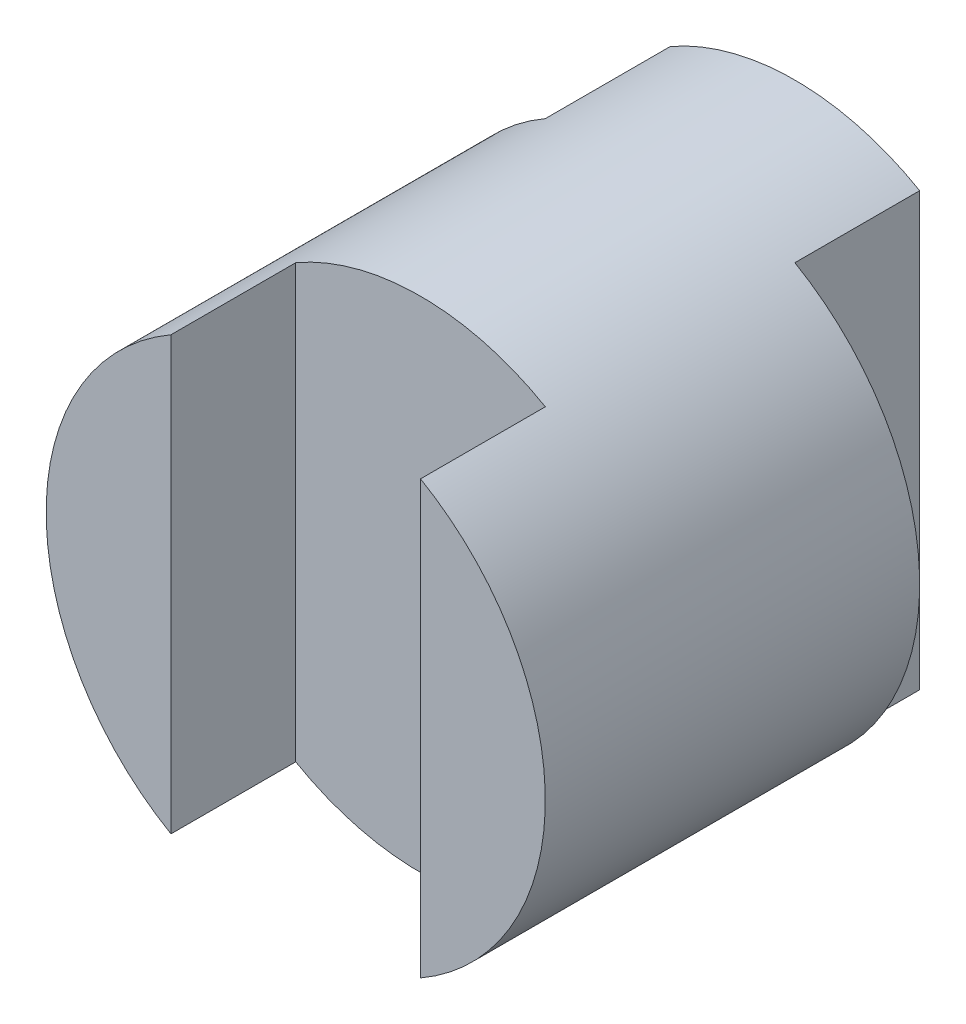
ISO-10303-21;
HEADER;
FILE_DESCRIPTION(('STEP AP214'),'2;1');
FILE_NAME('part.step','',(''),(''),'','','');
FILE_SCHEMA(('AUTOMOTIVE_DESIGN { 1 0 10303 214 1 1 1 1 }'));
ENDSEC;
DATA;
#1=APPLICATION_CONTEXT('core data for automotive mechanical design processes');
#2=APPLICATION_PROTOCOL_DEFINITION('international standard','automotive_design',2000,#1);
#3=PRODUCT_CONTEXT('',#1,'mechanical');
#4=PRODUCT('Part','Part','',(#3));
#5=PRODUCT_RELATED_PRODUCT_CATEGORY('part','',(#4));
#6=PRODUCT_DEFINITION_FORMATION('','',#4);
#7=PRODUCT_DEFINITION_CONTEXT('part definition',#1,'design');
#8=PRODUCT_DEFINITION('design','',#6,#7);
#9=PRODUCT_DEFINITION_SHAPE('','',#8);
#10=(LENGTH_UNIT() NAMED_UNIT(*) SI_UNIT(.MILLI.,.METRE.));
#11=(NAMED_UNIT(*) PLANE_ANGLE_UNIT() SI_UNIT($,.RADIAN.));
#12=(NAMED_UNIT(*) SI_UNIT($,.STERADIAN.) SOLID_ANGLE_UNIT());
#13=UNCERTAINTY_MEASURE_WITH_UNIT(LENGTH_MEASURE(1.E-05),#10,'distance_accuracy_value','');
#14=(GEOMETRIC_REPRESENTATION_CONTEXT(3) GLOBAL_UNCERTAINTY_ASSIGNED_CONTEXT((#13)) GLOBAL_UNIT_ASSIGNED_CONTEXT((#10,
#11,#12)) REPRESENTATION_CONTEXT('',''));
#15=CARTESIAN_POINT('',(0.,0.,0.));
#16=DIRECTION('',(0.,0.,1.));
#17=DIRECTION('',(1.,0.,0.));
#18=AXIS2_PLACEMENT_3D('',#15,#16,#17);
#19=CARTESIAN_POINT('',(0.,0.,4.));
#20=DIRECTION('',(0.,0.,1.));
#21=DIRECTION('',(1.,0.,0.));
#22=AXIS2_PLACEMENT_3D('',#19,#20,#21);
#23=PLANE('',#22);
#24=DIRECTION('',(0.,1.,0.));
#25=VECTOR('',#24,1.);
#26=CARTESIAN_POINT('',(1.,0.,4.));
#27=LINE('',#26,#25);
#28=CARTESIAN_POINT('',(1.,-1.73205080756888,4.));
#29=VERTEX_POINT('',#28);
#30=CARTESIAN_POINT('',(1.,1.73205080756888,4.));
#31=VERTEX_POINT('',#30);
#32=EDGE_CURVE('E127',#29,#31,#27,.T.);
#33=ORIENTED_EDGE('',*,*,#32,.F.);
#34=CARTESIAN_POINT('',(0.,0.,4.));
#35=DIRECTION('',(0.,0.,1.));
#36=DIRECTION('',(1.,0.,0.));
#37=AXIS2_PLACEMENT_3D('',#34,#35,#36);
#38=CIRCLE('',#37,2.);
#39=EDGE_CURVE('E117',#29,#31,#38,.T.);
#40=ORIENTED_EDGE('',*,*,#39,.T.);
#41=EDGE_LOOP('',(#33,#40));
#42=FACE_BOUND('',#41,.T.);
#43=ADVANCED_FACE('F32',(#42),#23,.T.);
#44=CARTESIAN_POINT('',(0.,0.,4.));
#45=DIRECTION('',(0.,0.,-1.));
#46=DIRECTION('',(-1.,0.,0.));
#47=AXIS2_PLACEMENT_3D('',#44,#45,#46);
#48=CYLINDRICAL_SURFACE('',#47,2.);
#49=CARTESIAN_POINT('',(0.,0.,3.));
#50=DIRECTION('',(0.,0.,-1.));
#51=DIRECTION('',(-1.,0.,0.));
#52=AXIS2_PLACEMENT_3D('',#49,#50,#51);
#53=CIRCLE('',#52,2.);
#54=CARTESIAN_POINT('',(-1.,1.73205080756888,3.));
#55=VERTEX_POINT('',#54);
#56=CARTESIAN_POINT('',(1.,1.73205080756888,3.));
#57=VERTEX_POINT('',#56);
#58=EDGE_CURVE('E104',#55,#57,#53,.T.);
#59=ORIENTED_EDGE('',*,*,#58,.T.);
#60=DIRECTION('',(0.,0.,-1.));
#61=VECTOR('',#60,1.);
#62=CARTESIAN_POINT('',(1.,1.73205080756888,4.));
#63=LINE('',#62,#61);
#64=EDGE_CURVE('E119',#57,#31,#63,.F.);
#65=ORIENTED_EDGE('',*,*,#64,.T.);
#66=ORIENTED_EDGE('',*,*,#39,.F.);
#67=DIRECTION('',(0.,0.,-1.));
#68=VECTOR('',#67,1.);
#69=CARTESIAN_POINT('',(1.,-1.73205080756888,4.));
#70=LINE('',#69,#68);
#71=CARTESIAN_POINT('',(1.,-1.73205080756888,3.));
#72=VERTEX_POINT('',#71);
#73=EDGE_CURVE('E115',#29,#72,#70,.T.);
#74=ORIENTED_EDGE('',*,*,#73,.T.);
#75=CARTESIAN_POINT('',(-1.,-1.73205080756888,3.));
#76=VERTEX_POINT('',#75);
#77=EDGE_CURVE('E132',#72,#76,#53,.T.);
#78=ORIENTED_EDGE('',*,*,#77,.T.);
#79=DIRECTION('',(0.,0.,-1.));
#80=VECTOR('',#79,1.);
#81=CARTESIAN_POINT('',(-1.,-1.73205080756888,4.));
#82=LINE('',#81,#80);
#83=CARTESIAN_POINT('',(-1.,-1.73205080756888,4.));
#84=VERTEX_POINT('',#83);
#85=EDGE_CURVE('E149',#76,#84,#82,.F.);
#86=ORIENTED_EDGE('',*,*,#85,.T.);
#87=CARTESIAN_POINT('',(-1.,1.73205080756888,4.));
#88=VERTEX_POINT('',#87);
#89=EDGE_CURVE('E125',#88,#84,#38,.T.);
#90=ORIENTED_EDGE('',*,*,#89,.F.);
#91=DIRECTION('',(0.,0.,-1.));
#92=VECTOR('',#91,1.);
#93=CARTESIAN_POINT('',(-1.,1.73205080756888,4.));
#94=LINE('',#93,#92);
#95=EDGE_CURVE('E55',#88,#55,#94,.T.);
#96=ORIENTED_EDGE('',*,*,#95,.T.);
#97=EDGE_LOOP('',(#59,#65,#66,#74,#78,#86,#90,#96));
#98=FACE_BOUND('',#97,.T.);
#99=CARTESIAN_POINT('',(0.,0.,1.));
#100=DIRECTION('',(0.,0.,1.));
#101=DIRECTION('',(1.,0.,0.));
#102=AXIS2_PLACEMENT_3D('',#99,#100,#101);
#103=CIRCLE('',#102,2.);
#104=CARTESIAN_POINT('',(1.,-1.73205080756888,1.));
#105=VERTEX_POINT('',#104);
#106=CARTESIAN_POINT('',(1.,1.73205080756888,1.));
#107=VERTEX_POINT('',#106);
#108=EDGE_CURVE('E11',#105,#107,#103,.T.);
#109=ORIENTED_EDGE('',*,*,#108,.T.);
#110=DIRECTION('',(0.,0.,-1.));
#111=VECTOR('',#110,1.);
#112=CARTESIAN_POINT('',(1.,1.73205080756888,4.));
#113=LINE('',#112,#111);
#114=CARTESIAN_POINT('',(1.,1.73205080756888,0.));
#115=VERTEX_POINT('',#114);
#116=EDGE_CURVE('E98',#107,#115,#113,.T.);
#117=ORIENTED_EDGE('',*,*,#116,.T.);
#118=CARTESIAN_POINT('',(0.,0.,0.));
#119=DIRECTION('',(0.,0.,1.));
#120=DIRECTION('',(1.,0.,0.));
#121=AXIS2_PLACEMENT_3D('',#118,#119,#120);
#122=CIRCLE('',#121,2.);
#123=CARTESIAN_POINT('',(-1.,1.73205080756888,0.));
#124=VERTEX_POINT('',#123);
#125=EDGE_CURVE('E107',#115,#124,#122,.T.);
#126=ORIENTED_EDGE('',*,*,#125,.T.);
#127=DIRECTION('',(0.,0.,-1.));
#128=VECTOR('',#127,1.);
#129=CARTESIAN_POINT('',(-1.,1.73205080756888,4.));
#130=LINE('',#129,#128);
#131=CARTESIAN_POINT('',(-1.,1.73205080756888,1.));
#132=VERTEX_POINT('',#131);
#133=EDGE_CURVE('E151',#124,#132,#130,.F.);
#134=ORIENTED_EDGE('',*,*,#133,.T.);
#135=CARTESIAN_POINT('',(0.,0.,1.));
#136=DIRECTION('',(0.,0.,1.));
#137=DIRECTION('',(1.,0.,0.));
#138=AXIS2_PLACEMENT_3D('',#135,#136,#137);
#139=CIRCLE('',#138,2.);
#140=CARTESIAN_POINT('',(-1.,-1.73205080756888,1.));
#141=VERTEX_POINT('',#140);
#142=EDGE_CURVE('E129',#132,#141,#139,.T.);
#143=ORIENTED_EDGE('',*,*,#142,.T.);
#144=DIRECTION('',(0.,0.,-1.));
#145=VECTOR('',#144,1.);
#146=CARTESIAN_POINT('',(-1.,-1.73205080756888,4.));
#147=LINE('',#146,#145);
#148=CARTESIAN_POINT('',(-1.,-1.73205080756888,0.));
#149=VERTEX_POINT('',#148);
#150=EDGE_CURVE('E157',#141,#149,#147,.T.);
#151=ORIENTED_EDGE('',*,*,#150,.T.);
#152=CARTESIAN_POINT('',(1.,-1.73205080756888,0.));
#153=VERTEX_POINT('',#152);
#154=EDGE_CURVE('E114',#149,#153,#122,.T.);
#155=ORIENTED_EDGE('',*,*,#154,.T.);
#156=DIRECTION('',(0.,0.,-1.));
#157=VECTOR('',#156,1.);
#158=CARTESIAN_POINT('',(1.,-1.73205080756888,4.));
#159=LINE('',#158,#157);
#160=EDGE_CURVE('E47',#153,#105,#159,.F.);
#161=ORIENTED_EDGE('',*,*,#160,.T.);
#162=EDGE_LOOP('',(#109,#117,#126,#134,#143,#151,#155,#161));
#163=FACE_BOUND('',#162,.T.);
#164=ADVANCED_FACE('F34',(#98,#163),#48,.T.);
#165=DIRECTION('',(0.,-1.,0.));
#166=VECTOR('',#165,1.);
#167=CARTESIAN_POINT('',(-1.,0.,4.));
#168=LINE('',#167,#166);
#169=EDGE_CURVE('E124',#88,#84,#168,.T.);
#170=ORIENTED_EDGE('',*,*,#169,.F.);
#171=ORIENTED_EDGE('',*,*,#89,.T.);
#172=EDGE_LOOP('',(#170,#171));
#173=FACE_BOUND('',#172,.T.);
#174=ADVANCED_FACE('F164',(#173),#23,.T.);
#175=CARTESIAN_POINT('',(0.,0.,0.));
#176=DIRECTION('',(0.,0.,1.));
#177=DIRECTION('',(1.,0.,0.));
#178=AXIS2_PLACEMENT_3D('',#175,#176,#177);
#179=PLANE('',#178);
#180=ORIENTED_EDGE('',*,*,#125,.F.);
#181=DIRECTION('',(0.,-1.,0.));
#182=VECTOR('',#181,1.);
#183=CARTESIAN_POINT('',(1.,0.,0.));
#184=LINE('',#183,#182);
#185=EDGE_CURVE('E40',#115,#153,#184,.T.);
#186=ORIENTED_EDGE('',*,*,#185,.T.);
#187=ORIENTED_EDGE('',*,*,#154,.F.);
#188=DIRECTION('',(0.,1.,0.));
#189=VECTOR('',#188,1.);
#190=CARTESIAN_POINT('',(-1.,0.,0.));
#191=LINE('',#190,#189);
#192=EDGE_CURVE('E113',#149,#124,#191,.T.);
#193=ORIENTED_EDGE('',*,*,#192,.T.);
#194=EDGE_LOOP('',(#180,#186,#187,#193));
#195=FACE_BOUND('',#194,.T.);
#196=ADVANCED_FACE('F112',(#195),#179,.F.);
#197=CARTESIAN_POINT('',(-2.31386891999832,-5.,1.));
#198=DIRECTION('',(0.,0.,1.));
#199=DIRECTION('',(1.,0.,0.));
#200=AXIS2_PLACEMENT_3D('',#197,#198,#199);
#201=PLANE('',#200);
#202=DIRECTION('',(0.,1.,0.));
#203=VECTOR('',#202,1.);
#204=CARTESIAN_POINT('',(-1.,-5.,1.));
#205=LINE('',#204,#203);
#206=EDGE_CURVE('E109',#141,#132,#205,.T.);
#207=ORIENTED_EDGE('',*,*,#206,.F.);
#208=ORIENTED_EDGE('',*,*,#142,.F.);
#209=EDGE_LOOP('',(#207,#208));
#210=FACE_BOUND('',#209,.T.);
#211=ADVANCED_FACE('F191',(#210),#201,.F.);
#212=CARTESIAN_POINT('',(-1.,-5.,1.));
#213=DIRECTION('',(1.,0.,0.));
#214=DIRECTION('',(0.,0.,-1.));
#215=AXIS2_PLACEMENT_3D('',#212,#213,#214);
#216=PLANE('',#215);
#217=ORIENTED_EDGE('',*,*,#206,.T.);
#218=ORIENTED_EDGE('',*,*,#133,.F.);
#219=ORIENTED_EDGE('',*,*,#192,.F.);
#220=ORIENTED_EDGE('',*,*,#150,.F.);
#221=EDGE_LOOP('',(#217,#218,#219,#220));
#222=FACE_BOUND('',#221,.T.);
#223=ADVANCED_FACE('F177',(#222),#216,.F.);
#224=CARTESIAN_POINT('',(1.,-5.,3.));
#225=DIRECTION('',(0.,0.,-1.));
#226=DIRECTION('',(-1.,0.,0.));
#227=AXIS2_PLACEMENT_3D('',#224,#225,#226);
#228=PLANE('',#227);
#229=DIRECTION('',(0.,1.,0.));
#230=VECTOR('',#229,1.);
#231=CARTESIAN_POINT('',(-1.,-5.,3.));
#232=LINE('',#231,#230);
#233=EDGE_CURVE('E145',#76,#55,#232,.T.);
#234=ORIENTED_EDGE('',*,*,#233,.F.);
#235=ORIENTED_EDGE('',*,*,#77,.F.);
#236=DIRECTION('',(0.,1.,0.));
#237=VECTOR('',#236,1.);
#238=CARTESIAN_POINT('',(1.,-5.,3.));
#239=LINE('',#238,#237);
#240=EDGE_CURVE('E147',#72,#57,#239,.T.);
#241=ORIENTED_EDGE('',*,*,#240,.T.);
#242=ORIENTED_EDGE('',*,*,#58,.F.);
#243=EDGE_LOOP('',(#234,#235,#241,#242));
#244=FACE_BOUND('',#243,.T.);
#245=ADVANCED_FACE('F144',(#244),#228,.F.);
#246=CARTESIAN_POINT('',(1.,-5.,4.));
#247=DIRECTION('',(1.,0.,0.));
#248=DIRECTION('',(0.,0.,-1.));
#249=AXIS2_PLACEMENT_3D('',#246,#247,#248);
#250=PLANE('',#249);
#251=ORIENTED_EDGE('',*,*,#32,.T.);
#252=ORIENTED_EDGE('',*,*,#64,.F.);
#253=ORIENTED_EDGE('',*,*,#240,.F.);
#254=ORIENTED_EDGE('',*,*,#73,.F.);
#255=EDGE_LOOP('',(#251,#252,#253,#254));
#256=FACE_BOUND('',#255,.T.);
#257=ADVANCED_FACE('F168',(#256),#250,.F.);
#258=CARTESIAN_POINT('',(-1.,-5.,3.));
#259=DIRECTION('',(-1.,0.,0.));
#260=DIRECTION('',(0.,0.,1.));
#261=AXIS2_PLACEMENT_3D('',#258,#259,#260);
#262=PLANE('',#261);
#263=ORIENTED_EDGE('',*,*,#169,.T.);
#264=ORIENTED_EDGE('',*,*,#85,.F.);
#265=ORIENTED_EDGE('',*,*,#233,.T.);
#266=ORIENTED_EDGE('',*,*,#95,.F.);
#267=EDGE_LOOP('',(#263,#264,#265,#266));
#268=FACE_BOUND('',#267,.T.);
#269=ADVANCED_FACE('F148',(#268),#262,.F.);
#270=CARTESIAN_POINT('',(2.,-5.,1.));
#271=DIRECTION('',(0.,0.,1.));
#272=DIRECTION('',(1.,0.,0.));
#273=AXIS2_PLACEMENT_3D('',#270,#271,#272);
#274=PLANE('',#273);
#275=ORIENTED_EDGE('',*,*,#108,.F.);
#276=DIRECTION('',(0.,1.,0.));
#277=VECTOR('',#276,1.);
#278=CARTESIAN_POINT('',(1.,-5.,1.));
#279=LINE('',#278,#277);
#280=EDGE_CURVE('E203',#105,#107,#279,.T.);
#281=ORIENTED_EDGE('',*,*,#280,.T.);
#282=EDGE_LOOP('',(#275,#281));
#283=FACE_BOUND('',#282,.T.);
#284=ADVANCED_FACE('F175',(#283),#274,.F.);
#285=CARTESIAN_POINT('',(1.,-5.,0.));
#286=DIRECTION('',(-1.,0.,0.));
#287=DIRECTION('',(0.,0.,1.));
#288=AXIS2_PLACEMENT_3D('',#285,#286,#287);
#289=PLANE('',#288);
#290=ORIENTED_EDGE('',*,*,#280,.F.);
#291=ORIENTED_EDGE('',*,*,#160,.F.);
#292=ORIENTED_EDGE('',*,*,#185,.F.);
#293=ORIENTED_EDGE('',*,*,#116,.F.);
#294=EDGE_LOOP('',(#290,#291,#292,#293));
#295=FACE_BOUND('',#294,.T.);
#296=ADVANCED_FACE('F97',(#295),#289,.F.);
#297=CLOSED_SHELL('',(#43,#164,#174,#196,#211,#223,#245,#257,#269,#284,#296));
#298=MANIFOLD_SOLID_BREP('B2',#297);
#299=ADVANCED_BREP_SHAPE_REPRESENTATION('',(#18,#298),#14);
#300=SHAPE_DEFINITION_REPRESENTATION(#9,#299);
ENDSEC;
END-ISO-10303-21;
